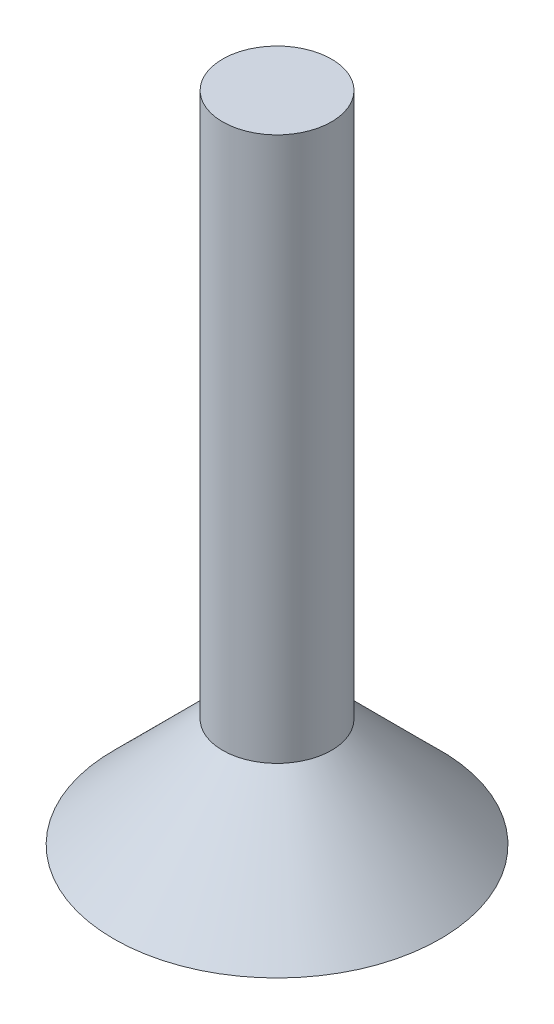
ISO-10303-21;
HEADER;
FILE_DESCRIPTION(('STEP AP214'),'2;1');
FILE_NAME('part.step','',(''),(''),'','','');
FILE_SCHEMA(('AUTOMOTIVE_DESIGN { 1 0 10303 214 1 1 1 1 }'));
ENDSEC;
DATA;
#1=APPLICATION_CONTEXT('core data for automotive mechanical design processes');
#2=APPLICATION_PROTOCOL_DEFINITION('international standard','automotive_design',2000,#1);
#3=PRODUCT_CONTEXT('',#1,'mechanical');
#4=PRODUCT('Part','Part','',(#3));
#5=PRODUCT_RELATED_PRODUCT_CATEGORY('part','',(#4));
#6=PRODUCT_DEFINITION_FORMATION('','',#4);
#7=PRODUCT_DEFINITION_CONTEXT('part definition',#1,'design');
#8=PRODUCT_DEFINITION('design','',#6,#7);
#9=PRODUCT_DEFINITION_SHAPE('','',#8);
#10=(LENGTH_UNIT() NAMED_UNIT(*) SI_UNIT(.MILLI.,.METRE.));
#11=(NAMED_UNIT(*) PLANE_ANGLE_UNIT() SI_UNIT($,.RADIAN.));
#12=(NAMED_UNIT(*) SI_UNIT($,.STERADIAN.) SOLID_ANGLE_UNIT());
#13=UNCERTAINTY_MEASURE_WITH_UNIT(LENGTH_MEASURE(1.E-05),#10,'distance_accuracy_value','');
#14=(GEOMETRIC_REPRESENTATION_CONTEXT(3) GLOBAL_UNCERTAINTY_ASSIGNED_CONTEXT((#13)) GLOBAL_UNIT_ASSIGNED_CONTEXT((#10,
#11,#12)) REPRESENTATION_CONTEXT('',''));
#15=CARTESIAN_POINT('',(0.,0.,0.));
#16=DIRECTION('',(0.,0.,1.));
#17=DIRECTION('',(1.,0.,0.));
#18=AXIS2_PLACEMENT_3D('',#15,#16,#17);
#19=CARTESIAN_POINT('',(0.,15.,0.));
#20=DIRECTION('',(0.,-1.,0.));
#21=DIRECTION('',(0.,0.,-1.));
#22=AXIS2_PLACEMENT_3D('',#19,#20,#21);
#23=PLANE('',#22);
#24=CARTESIAN_POINT('',(0.,15.,0.));
#25=DIRECTION('',(0.,1.,0.));
#26=DIRECTION('',(0.,0.,1.));
#27=AXIS2_PLACEMENT_3D('',#24,#25,#26);
#28=CIRCLE('',#27,1.25);
#29=CARTESIAN_POINT('',(0.,15.,1.25));
#30=VERTEX_POINT('',#29);
#31=EDGE_CURVE('E10',#30,#30,#28,.T.);
#32=ORIENTED_EDGE('',*,*,#31,.T.);
#33=EDGE_LOOP('',(#32));
#34=FACE_BOUND('',#33,.T.);
#35=ADVANCED_FACE('F33',(#34),#23,.F.);
#36=CARTESIAN_POINT('',(0.,49.8380396723279,0.));
#37=DIRECTION('',(0.,1.,0.));
#38=DIRECTION('',(0.,0.,1.));
#39=AXIS2_PLACEMENT_3D('',#36,#37,#38);
#40=CYLINDRICAL_SURFACE('',#39,1.25);
#41=ORIENTED_EDGE('',*,*,#31,.F.);
#42=EDGE_LOOP('',(#41));
#43=FACE_BOUND('',#42,.T.);
#44=CARTESIAN_POINT('',(0.,2.5,0.));
#45=DIRECTION('',(0.,1.,0.));
#46=DIRECTION('',(0.,0.,1.));
#47=AXIS2_PLACEMENT_3D('',#44,#45,#46);
#48=CIRCLE('',#47,1.25);
#49=CARTESIAN_POINT('',(0.,2.5,1.25));
#50=VERTEX_POINT('',#49);
#51=EDGE_CURVE('E39',#50,#50,#48,.T.);
#52=ORIENTED_EDGE('',*,*,#51,.T.);
#53=EDGE_LOOP('',(#52));
#54=FACE_BOUND('',#53,.T.);
#55=ADVANCED_FACE('F58',(#43,#54),#40,.T.);
#56=CARTESIAN_POINT('',(0.,0.,0.));
#57=DIRECTION('',(0.,-1.,0.));
#58=DIRECTION('',(0.,0.,-1.));
#59=AXIS2_PLACEMENT_3D('',#56,#57,#58);
#60=CONICAL_SURFACE('',#59,3.74999999999999,0.785398163397446);
#61=ORIENTED_EDGE('',*,*,#51,.F.);
#62=EDGE_LOOP('',(#61));
#63=FACE_BOUND('',#62,.T.);
#64=CARTESIAN_POINT('',(0.,0.,0.));
#65=DIRECTION('',(0.,1.,0.));
#66=DIRECTION('',(0.,0.,1.));
#67=AXIS2_PLACEMENT_3D('',#64,#65,#66);
#68=CIRCLE('',#67,3.74999999999999);
#69=CARTESIAN_POINT('',(0.,0.,3.74999999999999));
#70=VERTEX_POINT('',#69);
#71=EDGE_CURVE('E43',#70,#70,#68,.T.);
#72=ORIENTED_EDGE('',*,*,#71,.T.);
#73=EDGE_LOOP('',(#72));
#74=FACE_BOUND('',#73,.T.);
#75=ADVANCED_FACE('F50',(#63,#74),#60,.T.);
#76=CARTESIAN_POINT('',(3.74999999999999,0.,0.));
#77=DIRECTION('',(0.,1.,0.));
#78=DIRECTION('',(0.,0.,1.));
#79=AXIS2_PLACEMENT_3D('',#76,#77,#78);
#80=PLANE('',#79);
#81=ORIENTED_EDGE('',*,*,#71,.F.);
#82=EDGE_LOOP('',(#81));
#83=FACE_BOUND('',#82,.T.);
#84=ADVANCED_FACE('F52',(#83),#80,.F.);
#85=CLOSED_SHELL('',(#35,#55,#75,#84));
#86=MANIFOLD_SOLID_BREP('B2',#85);
#87=ADVANCED_BREP_SHAPE_REPRESENTATION('',(#18,#86),#14);
#88=SHAPE_DEFINITION_REPRESENTATION(#9,#87);
ENDSEC;
END-ISO-10303-21;
